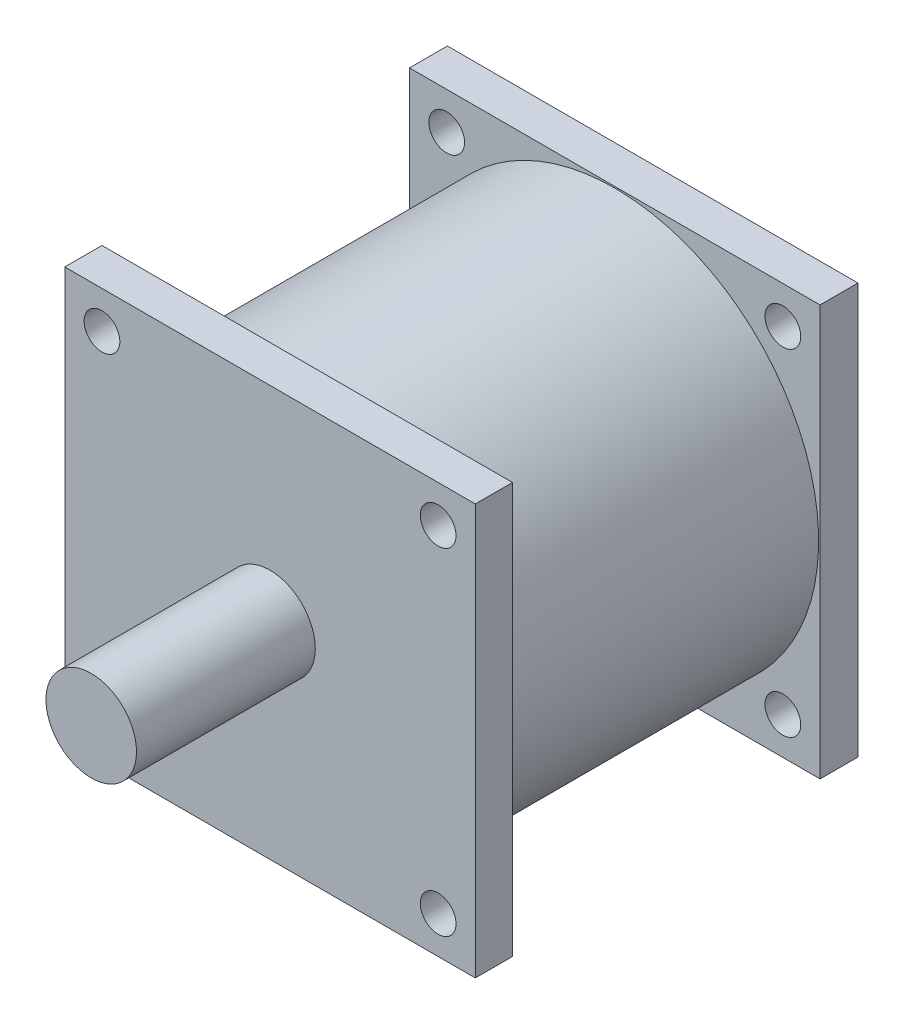
ISO-10303-21;
HEADER;
FILE_DESCRIPTION(('STEP AP214'),'2;1');
FILE_NAME('part.step','',(''),(''),'','','');
FILE_SCHEMA(('AUTOMOTIVE_DESIGN { 1 0 10303 214 1 1 1 1 }'));
ENDSEC;
DATA;
#1=APPLICATION_CONTEXT('core data for automotive mechanical design processes');
#2=APPLICATION_PROTOCOL_DEFINITION('international standard','automotive_design',2000,#1);
#3=PRODUCT_CONTEXT('',#1,'mechanical');
#4=PRODUCT('Part','Part','',(#3));
#5=PRODUCT_RELATED_PRODUCT_CATEGORY('part','',(#4));
#6=PRODUCT_DEFINITION_FORMATION('','',#4);
#7=PRODUCT_DEFINITION_CONTEXT('part definition',#1,'design');
#8=PRODUCT_DEFINITION('design','',#6,#7);
#9=PRODUCT_DEFINITION_SHAPE('','',#8);
#10=(LENGTH_UNIT() NAMED_UNIT(*) SI_UNIT(.MILLI.,.METRE.));
#11=(NAMED_UNIT(*) PLANE_ANGLE_UNIT() SI_UNIT($,.RADIAN.));
#12=(NAMED_UNIT(*) SI_UNIT($,.STERADIAN.) SOLID_ANGLE_UNIT());
#13=UNCERTAINTY_MEASURE_WITH_UNIT(LENGTH_MEASURE(1.E-05),#10,'distance_accuracy_value','');
#14=(GEOMETRIC_REPRESENTATION_CONTEXT(3) GLOBAL_UNCERTAINTY_ASSIGNED_CONTEXT((#13)) GLOBAL_UNIT_ASSIGNED_CONTEXT((#10,
#11,#12)) REPRESENTATION_CONTEXT('',''));
#15=CARTESIAN_POINT('',(0.,0.,0.));
#16=DIRECTION('',(0.,0.,1.));
#17=DIRECTION('',(1.,0.,0.));
#18=AXIS2_PLACEMENT_3D('',#15,#16,#17);
#19=CARTESIAN_POINT('',(0.,0.,48.2));
#20=DIRECTION('',(0.,0.,1.));
#21=DIRECTION('',(1.,0.,0.));
#22=AXIS2_PLACEMENT_3D('',#19,#20,#21);
#23=PLANE('',#22);
#24=CARTESIAN_POINT('',(-23.5,23.5,48.2));
#25=DIRECTION('',(0.,0.,1.));
#26=DIRECTION('',(1.,0.,0.));
#27=AXIS2_PLACEMENT_3D('',#24,#25,#26);
#28=CIRCLE('',#27,2.5);
#29=CARTESIAN_POINT('',(-21.,23.5,48.2));
#30=VERTEX_POINT('',#29);
#31=EDGE_CURVE('E441',#30,#30,#28,.T.);
#32=ORIENTED_EDGE('',*,*,#31,.F.);
#33=EDGE_LOOP('',(#32));
#34=FACE_BOUND('',#33,.T.);
#35=CARTESIAN_POINT('',(23.5,23.5,48.2));
#36=DIRECTION('',(0.,0.,1.));
#37=DIRECTION('',(1.,0.,0.));
#38=AXIS2_PLACEMENT_3D('',#35,#36,#37);
#39=CIRCLE('',#38,2.5);
#40=CARTESIAN_POINT('',(26.,23.5,48.2));
#41=VERTEX_POINT('',#40);
#42=EDGE_CURVE('E447',#41,#41,#39,.T.);
#43=ORIENTED_EDGE('',*,*,#42,.F.);
#44=EDGE_LOOP('',(#43));
#45=FACE_BOUND('',#44,.T.);
#46=CARTESIAN_POINT('',(23.5,-23.5,48.2));
#47=DIRECTION('',(0.,0.,1.));
#48=DIRECTION('',(1.,0.,0.));
#49=AXIS2_PLACEMENT_3D('',#46,#47,#48);
#50=CIRCLE('',#49,2.5);
#51=CARTESIAN_POINT('',(26.,-23.5,48.2));
#52=VERTEX_POINT('',#51);
#53=EDGE_CURVE('E453',#52,#52,#50,.T.);
#54=ORIENTED_EDGE('',*,*,#53,.F.);
#55=EDGE_LOOP('',(#54));
#56=FACE_BOUND('',#55,.T.);
#57=CARTESIAN_POINT('',(-23.5,-23.5,48.2));
#58=DIRECTION('',(0.,0.,1.));
#59=DIRECTION('',(1.,0.,0.));
#60=AXIS2_PLACEMENT_3D('',#57,#58,#59);
#61=CIRCLE('',#60,2.5);
#62=CARTESIAN_POINT('',(-21.,-23.5,48.2));
#63=VERTEX_POINT('',#62);
#64=EDGE_CURVE('E459',#63,#63,#61,.T.);
#65=ORIENTED_EDGE('',*,*,#64,.F.);
#66=EDGE_LOOP('',(#65));
#67=FACE_BOUND('',#66,.T.);
#68=DIRECTION('',(0.,1.,0.));
#69=VECTOR('',#68,1.);
#70=CARTESIAN_POINT('',(28.7,-28.7,48.2));
#71=LINE('',#70,#69);
#72=CARTESIAN_POINT('',(28.7,-28.7,48.2));
#73=VERTEX_POINT('',#72);
#74=CARTESIAN_POINT('',(28.7,28.7,48.2));
#75=VERTEX_POINT('',#74);
#76=EDGE_CURVE('E81',#73,#75,#71,.T.);
#77=ORIENTED_EDGE('',*,*,#76,.T.);
#78=DIRECTION('',(-1.,0.,0.));
#79=VECTOR('',#78,1.);
#80=CARTESIAN_POINT('',(28.7,28.7,48.2));
#81=LINE('',#80,#79);
#82=CARTESIAN_POINT('',(-28.7,28.7,48.2));
#83=VERTEX_POINT('',#82);
#84=EDGE_CURVE('E156',#75,#83,#81,.T.);
#85=ORIENTED_EDGE('',*,*,#84,.T.);
#86=DIRECTION('',(0.,-1.,0.));
#87=VECTOR('',#86,1.);
#88=CARTESIAN_POINT('',(-28.7,28.7,48.2));
#89=LINE('',#88,#87);
#90=CARTESIAN_POINT('',(-28.7,-28.7,48.2));
#91=VERTEX_POINT('',#90);
#92=EDGE_CURVE('E159',#83,#91,#89,.T.);
#93=ORIENTED_EDGE('',*,*,#92,.T.);
#94=DIRECTION('',(1.,0.,0.));
#95=VECTOR('',#94,1.);
#96=CARTESIAN_POINT('',(-28.7,-28.7,48.2));
#97=LINE('',#96,#95);
#98=EDGE_CURVE('E51',#91,#73,#97,.T.);
#99=ORIENTED_EDGE('',*,*,#98,.T.);
#100=EDGE_LOOP('',(#77,#85,#93,#99));
#101=FACE_BOUND('',#100,.T.);
#102=CARTESIAN_POINT('',(0.,0.,48.2));
#103=DIRECTION('',(0.,0.,1.));
#104=DIRECTION('',(1.,0.,0.));
#105=AXIS2_PLACEMENT_3D('',#102,#103,#104);
#106=CIRCLE('',#105,6.33);
#107=CARTESIAN_POINT('',(6.33,0.,48.2));
#108=VERTEX_POINT('',#107);
#109=EDGE_CURVE('E465',#108,#108,#106,.T.);
#110=ORIENTED_EDGE('',*,*,#109,.F.);
#111=EDGE_LOOP('',(#110));
#112=FACE_BOUND('',#111,.T.);
#113=ADVANCED_FACE('F34',(#34,#45,#56,#67,#101,#112),#23,.T.);
#114=CARTESIAN_POINT('',(0.,0.,43.));
#115=DIRECTION('',(0.,0.,-1.));
#116=DIRECTION('',(-1.,0.,0.));
#117=AXIS2_PLACEMENT_3D('',#114,#115,#116);
#118=CYLINDRICAL_SURFACE('',#117,28.5);
#119=CARTESIAN_POINT('',(0.,0.,43.));
#120=DIRECTION('',(0.,0.,1.));
#121=DIRECTION('',(1.,0.,0.));
#122=AXIS2_PLACEMENT_3D('',#119,#120,#121);
#123=CIRCLE('',#122,28.5);
#124=CARTESIAN_POINT('',(28.5,0.,43.));
#125=VERTEX_POINT('',#124);
#126=EDGE_CURVE('E11',#125,#125,#123,.T.);
#127=ORIENTED_EDGE('',*,*,#126,.F.);
#128=EDGE_LOOP('',(#127));
#129=FACE_BOUND('',#128,.T.);
#130=CARTESIAN_POINT('',(0.,0.,0.));
#131=DIRECTION('',(0.,0.,-1.));
#132=DIRECTION('',(-1.,0.,0.));
#133=AXIS2_PLACEMENT_3D('',#130,#131,#132);
#134=CIRCLE('',#133,28.5);
#135=CARTESIAN_POINT('',(-28.5,0.,0.));
#136=VERTEX_POINT('',#135);
#137=EDGE_CURVE('E127',#136,#136,#134,.T.);
#138=ORIENTED_EDGE('',*,*,#137,.F.);
#139=EDGE_LOOP('',(#138));
#140=FACE_BOUND('',#139,.T.);
#141=ADVANCED_FACE('F36',(#129,#140),#118,.T.);
#142=CARTESIAN_POINT('',(0.,0.,43.));
#143=DIRECTION('',(0.,0.,1.));
#144=DIRECTION('',(1.,0.,0.));
#145=AXIS2_PLACEMENT_3D('',#142,#143,#144);
#146=PLANE('',#145);
#147=CARTESIAN_POINT('',(-23.5,23.5,43.));
#148=DIRECTION('',(0.,0.,1.));
#149=DIRECTION('',(1.,0.,0.));
#150=AXIS2_PLACEMENT_3D('',#147,#148,#149);
#151=CIRCLE('',#150,2.5);
#152=CARTESIAN_POINT('',(-21.,23.5,43.));
#153=VERTEX_POINT('',#152);
#154=EDGE_CURVE('E444',#153,#153,#151,.T.);
#155=ORIENTED_EDGE('',*,*,#154,.T.);
#156=EDGE_LOOP('',(#155));
#157=FACE_BOUND('',#156,.T.);
#158=CARTESIAN_POINT('',(23.5,23.5,43.));
#159=DIRECTION('',(0.,0.,1.));
#160=DIRECTION('',(1.,0.,0.));
#161=AXIS2_PLACEMENT_3D('',#158,#159,#160);
#162=CIRCLE('',#161,2.5);
#163=CARTESIAN_POINT('',(26.,23.5,43.));
#164=VERTEX_POINT('',#163);
#165=EDGE_CURVE('E450',#164,#164,#162,.T.);
#166=ORIENTED_EDGE('',*,*,#165,.T.);
#167=EDGE_LOOP('',(#166));
#168=FACE_BOUND('',#167,.T.);
#169=CARTESIAN_POINT('',(23.5,-23.5,43.));
#170=DIRECTION('',(0.,0.,1.));
#171=DIRECTION('',(1.,0.,0.));
#172=AXIS2_PLACEMENT_3D('',#169,#170,#171);
#173=CIRCLE('',#172,2.5);
#174=CARTESIAN_POINT('',(26.,-23.5,43.));
#175=VERTEX_POINT('',#174);
#176=EDGE_CURVE('E456',#175,#175,#173,.T.);
#177=ORIENTED_EDGE('',*,*,#176,.T.);
#178=EDGE_LOOP('',(#177));
#179=FACE_BOUND('',#178,.T.);
#180=CARTESIAN_POINT('',(-23.5,-23.5,43.));
#181=DIRECTION('',(0.,0.,1.));
#182=DIRECTION('',(1.,0.,0.));
#183=AXIS2_PLACEMENT_3D('',#180,#181,#182);
#184=CIRCLE('',#183,2.5);
#185=CARTESIAN_POINT('',(-21.,-23.5,43.));
#186=VERTEX_POINT('',#185);
#187=EDGE_CURVE('E462',#186,#186,#184,.T.);
#188=ORIENTED_EDGE('',*,*,#187,.T.);
#189=EDGE_LOOP('',(#188));
#190=FACE_BOUND('',#189,.T.);
#191=DIRECTION('',(0.,1.,0.));
#192=VECTOR('',#191,1.);
#193=CARTESIAN_POINT('',(28.7,0.,43.));
#194=LINE('',#193,#192);
#195=CARTESIAN_POINT('',(28.7,-28.7,43.));
#196=VERTEX_POINT('',#195);
#197=CARTESIAN_POINT('',(28.7,28.7,43.));
#198=VERTEX_POINT('',#197);
#199=EDGE_CURVE('E76',#196,#198,#194,.T.);
#200=ORIENTED_EDGE('',*,*,#199,.F.);
#201=DIRECTION('',(1.,0.,0.));
#202=VECTOR('',#201,1.);
#203=CARTESIAN_POINT('',(-28.7,-28.7,43.));
#204=LINE('',#203,#202);
#205=CARTESIAN_POINT('',(-28.7,-28.7,43.));
#206=VERTEX_POINT('',#205);
#207=EDGE_CURVE('E157',#206,#196,#204,.T.);
#208=ORIENTED_EDGE('',*,*,#207,.F.);
#209=DIRECTION('',(0.,-1.,0.));
#210=VECTOR('',#209,1.);
#211=CARTESIAN_POINT('',(-28.7,28.7,43.));
#212=LINE('',#211,#210);
#213=CARTESIAN_POINT('',(-28.7,28.7,43.));
#214=VERTEX_POINT('',#213);
#215=EDGE_CURVE('E69',#214,#206,#212,.T.);
#216=ORIENTED_EDGE('',*,*,#215,.F.);
#217=DIRECTION('',(-1.,0.,0.));
#218=VECTOR('',#217,1.);
#219=CARTESIAN_POINT('',(28.7,28.7,43.));
#220=LINE('',#219,#218);
#221=EDGE_CURVE('E164',#198,#214,#220,.T.);
#222=ORIENTED_EDGE('',*,*,#221,.F.);
#223=EDGE_LOOP('',(#200,#208,#216,#222));
#224=FACE_BOUND('',#223,.T.);
#225=ORIENTED_EDGE('',*,*,#126,.T.);
#226=EDGE_LOOP('',(#225));
#227=FACE_BOUND('',#226,.T.);
#228=ADVANCED_FACE('F179',(#157,#168,#179,#190,#224,#227),#146,.F.);
#229=CARTESIAN_POINT('',(28.7,0.,48.2));
#230=DIRECTION('',(-1.,0.,0.));
#231=DIRECTION('',(0.,0.,1.));
#232=AXIS2_PLACEMENT_3D('',#229,#230,#231);
#233=PLANE('',#232);
#234=ORIENTED_EDGE('',*,*,#199,.T.);
#235=DIRECTION('',(0.,0.,-1.));
#236=VECTOR('',#235,1.);
#237=CARTESIAN_POINT('',(28.7,28.7,48.2));
#238=LINE('',#237,#236);
#239=EDGE_CURVE('E43',#75,#198,#238,.T.);
#240=ORIENTED_EDGE('',*,*,#239,.F.);
#241=ORIENTED_EDGE('',*,*,#76,.F.);
#242=DIRECTION('',(0.,0.,-1.));
#243=VECTOR('',#242,1.);
#244=CARTESIAN_POINT('',(28.7,-28.7,48.2));
#245=LINE('',#244,#243);
#246=EDGE_CURVE('E162',#73,#196,#245,.T.);
#247=ORIENTED_EDGE('',*,*,#246,.T.);
#248=EDGE_LOOP('',(#234,#240,#241,#247));
#249=FACE_BOUND('',#248,.T.);
#250=ADVANCED_FACE('F183',(#249),#233,.F.);
#251=CARTESIAN_POINT('',(28.7,28.7,48.2));
#252=DIRECTION('',(0.,-1.,0.));
#253=DIRECTION('',(1.,0.,0.));
#254=AXIS2_PLACEMENT_3D('',#251,#252,#253);
#255=PLANE('',#254);
#256=ORIENTED_EDGE('',*,*,#221,.T.);
#257=DIRECTION('',(0.,0.,-1.));
#258=VECTOR('',#257,1.);
#259=CARTESIAN_POINT('',(-28.7,28.7,48.2));
#260=LINE('',#259,#258);
#261=EDGE_CURVE('E172',#83,#214,#260,.T.);
#262=ORIENTED_EDGE('',*,*,#261,.F.);
#263=ORIENTED_EDGE('',*,*,#84,.F.);
#264=ORIENTED_EDGE('',*,*,#239,.T.);
#265=EDGE_LOOP('',(#256,#262,#263,#264));
#266=FACE_BOUND('',#265,.T.);
#267=ADVANCED_FACE('F176',(#266),#255,.F.);
#268=CARTESIAN_POINT('',(-28.7,28.7,48.2));
#269=DIRECTION('',(1.,0.,0.));
#270=DIRECTION('',(0.,1.,0.));
#271=AXIS2_PLACEMENT_3D('',#268,#269,#270);
#272=PLANE('',#271);
#273=ORIENTED_EDGE('',*,*,#215,.T.);
#274=DIRECTION('',(0.,0.,-1.));
#275=VECTOR('',#274,1.);
#276=CARTESIAN_POINT('',(-28.7,-28.7,48.2));
#277=LINE('',#276,#275);
#278=EDGE_CURVE('E170',#91,#206,#277,.T.);
#279=ORIENTED_EDGE('',*,*,#278,.F.);
#280=ORIENTED_EDGE('',*,*,#92,.F.);
#281=ORIENTED_EDGE('',*,*,#261,.T.);
#282=EDGE_LOOP('',(#273,#279,#280,#281));
#283=FACE_BOUND('',#282,.T.);
#284=ADVANCED_FACE('F189',(#283),#272,.F.);
#285=CARTESIAN_POINT('',(-28.7,-28.7,48.2));
#286=DIRECTION('',(0.,1.,0.));
#287=DIRECTION('',(-1.,0.,0.));
#288=AXIS2_PLACEMENT_3D('',#285,#286,#287);
#289=PLANE('',#288);
#290=ORIENTED_EDGE('',*,*,#207,.T.);
#291=ORIENTED_EDGE('',*,*,#246,.F.);
#292=ORIENTED_EDGE('',*,*,#98,.F.);
#293=ORIENTED_EDGE('',*,*,#278,.T.);
#294=EDGE_LOOP('',(#290,#291,#292,#293));
#295=FACE_BOUND('',#294,.T.);
#296=ADVANCED_FACE('F182',(#295),#289,.F.);
#297=CARTESIAN_POINT('',(0.,0.,0.));
#298=DIRECTION('',(0.,0.,-1.));
#299=DIRECTION('',(-1.,0.,0.));
#300=AXIS2_PLACEMENT_3D('',#297,#298,#299);
#301=PLANE('',#300);
#302=CARTESIAN_POINT('',(-23.5,23.5,0.));
#303=DIRECTION('',(0.,0.,-1.));
#304=DIRECTION('',(-1.,0.,0.));
#305=AXIS2_PLACEMENT_3D('',#302,#303,#304);
#306=CIRCLE('',#305,2.49999999999999);
#307=CARTESIAN_POINT('',(-26.,23.5,0.));
#308=VERTEX_POINT('',#307);
#309=EDGE_CURVE('E419',#308,#308,#306,.T.);
#310=ORIENTED_EDGE('',*,*,#309,.T.);
#311=EDGE_LOOP('',(#310));
#312=FACE_BOUND('',#311,.T.);
#313=CARTESIAN_POINT('',(23.5,23.5,0.));
#314=DIRECTION('',(0.,0.,-1.));
#315=DIRECTION('',(-1.,0.,0.));
#316=AXIS2_PLACEMENT_3D('',#313,#314,#315);
#317=CIRCLE('',#316,2.49999999999999);
#318=CARTESIAN_POINT('',(21.,23.5,0.));
#319=VERTEX_POINT('',#318);
#320=EDGE_CURVE('E423',#319,#319,#317,.T.);
#321=ORIENTED_EDGE('',*,*,#320,.T.);
#322=EDGE_LOOP('',(#321));
#323=FACE_BOUND('',#322,.T.);
#324=CARTESIAN_POINT('',(23.5,-23.5,0.));
#325=DIRECTION('',(0.,0.,-1.));
#326=DIRECTION('',(-1.,0.,0.));
#327=AXIS2_PLACEMENT_3D('',#324,#325,#326);
#328=CIRCLE('',#327,2.49999999999999);
#329=CARTESIAN_POINT('',(21.,-23.5,0.));
#330=VERTEX_POINT('',#329);
#331=EDGE_CURVE('E432',#330,#330,#328,.T.);
#332=ORIENTED_EDGE('',*,*,#331,.T.);
#333=EDGE_LOOP('',(#332));
#334=FACE_BOUND('',#333,.T.);
#335=CARTESIAN_POINT('',(-23.5,-23.5,0.));
#336=DIRECTION('',(0.,0.,-1.));
#337=DIRECTION('',(-1.,0.,0.));
#338=AXIS2_PLACEMENT_3D('',#335,#336,#337);
#339=CIRCLE('',#338,2.49999999999999);
#340=CARTESIAN_POINT('',(-26.,-23.5,0.));
#341=VERTEX_POINT('',#340);
#342=EDGE_CURVE('E438',#341,#341,#339,.T.);
#343=ORIENTED_EDGE('',*,*,#342,.T.);
#344=EDGE_LOOP('',(#343));
#345=FACE_BOUND('',#344,.T.);
#346=DIRECTION('',(0.,1.,0.));
#347=VECTOR('',#346,1.);
#348=CARTESIAN_POINT('',(-28.7,0.,0.));
#349=LINE('',#348,#347);
#350=CARTESIAN_POINT('',(-28.7,-28.7,0.));
#351=VERTEX_POINT('',#350);
#352=CARTESIAN_POINT('',(-28.7,28.7,0.));
#353=VERTEX_POINT('',#352);
#354=EDGE_CURVE('E124',#351,#353,#349,.T.);
#355=ORIENTED_EDGE('',*,*,#354,.F.);
#356=DIRECTION('',(-1.,0.,0.));
#357=VECTOR('',#356,1.);
#358=CARTESIAN_POINT('',(28.7,-28.7,0.));
#359=LINE('',#358,#357);
#360=CARTESIAN_POINT('',(28.7,-28.7,0.));
#361=VERTEX_POINT('',#360);
#362=EDGE_CURVE('E119',#361,#351,#359,.T.);
#363=ORIENTED_EDGE('',*,*,#362,.F.);
#364=DIRECTION('',(0.,-1.,0.));
#365=VECTOR('',#364,1.);
#366=CARTESIAN_POINT('',(28.7,28.7,0.));
#367=LINE('',#366,#365);
#368=CARTESIAN_POINT('',(28.7,28.7,0.));
#369=VERTEX_POINT('',#368);
#370=EDGE_CURVE('E144',#369,#361,#367,.T.);
#371=ORIENTED_EDGE('',*,*,#370,.F.);
#372=DIRECTION('',(1.,0.,0.));
#373=VECTOR('',#372,1.);
#374=CARTESIAN_POINT('',(-28.7,28.7,0.));
#375=LINE('',#374,#373);
#376=EDGE_CURVE('E141',#353,#369,#375,.T.);
#377=ORIENTED_EDGE('',*,*,#376,.F.);
#378=EDGE_LOOP('',(#355,#363,#371,#377));
#379=FACE_BOUND('',#378,.T.);
#380=ORIENTED_EDGE('',*,*,#137,.T.);
#381=EDGE_LOOP('',(#380));
#382=FACE_BOUND('',#381,.T.);
#383=ADVANCED_FACE('F207',(#312,#323,#334,#345,#379,#382),#301,.F.);
#384=CARTESIAN_POINT('',(-28.7,0.,-5.3));
#385=DIRECTION('',(1.,0.,0.));
#386=DIRECTION('',(0.,0.,-1.));
#387=AXIS2_PLACEMENT_3D('',#384,#385,#386);
#388=PLANE('',#387);
#389=ORIENTED_EDGE('',*,*,#354,.T.);
#390=DIRECTION('',(0.,0.,1.));
#391=VECTOR('',#390,1.);
#392=CARTESIAN_POINT('',(-28.7,28.7,-5.3));
#393=LINE('',#392,#391);
#394=CARTESIAN_POINT('',(-28.7,28.7,-5.3));
#395=VERTEX_POINT('',#394);
#396=EDGE_CURVE('E122',#395,#353,#393,.T.);
#397=ORIENTED_EDGE('',*,*,#396,.F.);
#398=DIRECTION('',(0.,1.,0.));
#399=VECTOR('',#398,1.);
#400=CARTESIAN_POINT('',(-28.7,-28.7,-5.3));
#401=LINE('',#400,#399);
#402=CARTESIAN_POINT('',(-28.7,-28.7,-5.3));
#403=VERTEX_POINT('',#402);
#404=EDGE_CURVE('E108',#403,#395,#401,.T.);
#405=ORIENTED_EDGE('',*,*,#404,.F.);
#406=DIRECTION('',(0.,0.,1.));
#407=VECTOR('',#406,1.);
#408=CARTESIAN_POINT('',(-28.7,-28.7,-5.3));
#409=LINE('',#408,#407);
#410=EDGE_CURVE('E139',#403,#351,#409,.T.);
#411=ORIENTED_EDGE('',*,*,#410,.T.);
#412=EDGE_LOOP('',(#389,#397,#405,#411));
#413=FACE_BOUND('',#412,.T.);
#414=ADVANCED_FACE('F123',(#413),#388,.F.);
#415=CARTESIAN_POINT('',(-28.7,28.7,-5.3));
#416=DIRECTION('',(0.,-1.,0.));
#417=DIRECTION('',(1.,0.,0.));
#418=AXIS2_PLACEMENT_3D('',#415,#416,#417);
#419=PLANE('',#418);
#420=ORIENTED_EDGE('',*,*,#376,.T.);
#421=DIRECTION('',(0.,0.,1.));
#422=VECTOR('',#421,1.);
#423=CARTESIAN_POINT('',(28.7,28.7,-5.3));
#424=LINE('',#423,#422);
#425=CARTESIAN_POINT('',(28.7,28.7,-5.3));
#426=VERTEX_POINT('',#425);
#427=EDGE_CURVE('E128',#426,#369,#424,.T.);
#428=ORIENTED_EDGE('',*,*,#427,.F.);
#429=DIRECTION('',(1.,0.,0.));
#430=VECTOR('',#429,1.);
#431=CARTESIAN_POINT('',(-28.7,28.7,-5.3));
#432=LINE('',#431,#430);
#433=EDGE_CURVE('E112',#395,#426,#432,.T.);
#434=ORIENTED_EDGE('',*,*,#433,.F.);
#435=ORIENTED_EDGE('',*,*,#396,.T.);
#436=EDGE_LOOP('',(#420,#428,#434,#435));
#437=FACE_BOUND('',#436,.T.);
#438=ADVANCED_FACE('F130',(#437),#419,.F.);
#439=CARTESIAN_POINT('',(28.7,28.7,-5.3));
#440=DIRECTION('',(-1.,0.,0.));
#441=DIRECTION('',(0.,-1.,0.));
#442=AXIS2_PLACEMENT_3D('',#439,#440,#441);
#443=PLANE('',#442);
#444=ORIENTED_EDGE('',*,*,#370,.T.);
#445=DIRECTION('',(0.,0.,1.));
#446=VECTOR('',#445,1.);
#447=CARTESIAN_POINT('',(28.7,-28.7,-5.3));
#448=LINE('',#447,#446);
#449=CARTESIAN_POINT('',(28.7,-28.7,-5.3));
#450=VERTEX_POINT('',#449);
#451=EDGE_CURVE('E149',#450,#361,#448,.T.);
#452=ORIENTED_EDGE('',*,*,#451,.F.);
#453=DIRECTION('',(0.,-1.,0.));
#454=VECTOR('',#453,1.);
#455=CARTESIAN_POINT('',(28.7,28.7,-5.3));
#456=LINE('',#455,#454);
#457=EDGE_CURVE('E133',#426,#450,#456,.T.);
#458=ORIENTED_EDGE('',*,*,#457,.F.);
#459=ORIENTED_EDGE('',*,*,#427,.T.);
#460=EDGE_LOOP('',(#444,#452,#458,#459));
#461=FACE_BOUND('',#460,.T.);
#462=ADVANCED_FACE('F237',(#461),#443,.F.);
#463=CARTESIAN_POINT('',(28.7,-28.7,-5.3));
#464=DIRECTION('',(0.,1.,0.));
#465=DIRECTION('',(0.,0.,1.));
#466=AXIS2_PLACEMENT_3D('',#463,#464,#465);
#467=PLANE('',#466);
#468=ORIENTED_EDGE('',*,*,#362,.T.);
#469=ORIENTED_EDGE('',*,*,#410,.F.);
#470=DIRECTION('',(-1.,0.,0.));
#471=VECTOR('',#470,1.);
#472=CARTESIAN_POINT('',(28.7,-28.7,-5.3));
#473=LINE('',#472,#471);
#474=EDGE_CURVE('E115',#450,#403,#473,.T.);
#475=ORIENTED_EDGE('',*,*,#474,.F.);
#476=ORIENTED_EDGE('',*,*,#451,.T.);
#477=EDGE_LOOP('',(#468,#469,#475,#476));
#478=FACE_BOUND('',#477,.T.);
#479=ADVANCED_FACE('F243',(#478),#467,.F.);
#480=CARTESIAN_POINT('',(0.,0.,-5.3));
#481=DIRECTION('',(0.,0.,-1.));
#482=DIRECTION('',(-1.,0.,0.));
#483=AXIS2_PLACEMENT_3D('',#480,#481,#482);
#484=PLANE('',#483);
#485=CARTESIAN_POINT('',(-23.5,23.5,-5.3));
#486=DIRECTION('',(0.,0.,1.));
#487=DIRECTION('',(1.,0.,0.));
#488=AXIS2_PLACEMENT_3D('',#485,#486,#487);
#489=CIRCLE('',#488,2.49999999999999);
#490=CARTESIAN_POINT('',(-21.,23.5,-5.3));
#491=VERTEX_POINT('',#490);
#492=EDGE_CURVE('E416',#491,#491,#489,.T.);
#493=ORIENTED_EDGE('',*,*,#492,.T.);
#494=EDGE_LOOP('',(#493));
#495=FACE_BOUND('',#494,.T.);
#496=CARTESIAN_POINT('',(23.5,23.5,-5.3));
#497=DIRECTION('',(0.,0.,1.));
#498=DIRECTION('',(1.,0.,0.));
#499=AXIS2_PLACEMENT_3D('',#496,#497,#498);
#500=CIRCLE('',#499,2.49999999999999);
#501=CARTESIAN_POINT('',(26.,23.5,-5.3));
#502=VERTEX_POINT('',#501);
#503=EDGE_CURVE('E420',#502,#502,#500,.T.);
#504=ORIENTED_EDGE('',*,*,#503,.T.);
#505=EDGE_LOOP('',(#504));
#506=FACE_BOUND('',#505,.T.);
#507=CARTESIAN_POINT('',(23.5,-23.5,-5.3));
#508=DIRECTION('',(0.,0.,1.));
#509=DIRECTION('',(1.,0.,0.));
#510=AXIS2_PLACEMENT_3D('',#507,#508,#509);
#511=CIRCLE('',#510,2.49999999999999);
#512=CARTESIAN_POINT('',(26.,-23.5,-5.3));
#513=VERTEX_POINT('',#512);
#514=EDGE_CURVE('E429',#513,#513,#511,.T.);
#515=ORIENTED_EDGE('',*,*,#514,.T.);
#516=EDGE_LOOP('',(#515));
#517=FACE_BOUND('',#516,.T.);
#518=CARTESIAN_POINT('',(-23.5,-23.5,-5.3));
#519=DIRECTION('',(0.,0.,1.));
#520=DIRECTION('',(1.,0.,0.));
#521=AXIS2_PLACEMENT_3D('',#518,#519,#520);
#522=CIRCLE('',#521,2.49999999999999);
#523=CARTESIAN_POINT('',(-21.,-23.5,-5.3));
#524=VERTEX_POINT('',#523);
#525=EDGE_CURVE('E435',#524,#524,#522,.T.);
#526=ORIENTED_EDGE('',*,*,#525,.T.);
#527=EDGE_LOOP('',(#526));
#528=FACE_BOUND('',#527,.T.);
#529=ORIENTED_EDGE('',*,*,#404,.T.);
#530=ORIENTED_EDGE('',*,*,#433,.T.);
#531=ORIENTED_EDGE('',*,*,#457,.T.);
#532=ORIENTED_EDGE('',*,*,#474,.T.);
#533=EDGE_LOOP('',(#529,#530,#531,#532));
#534=FACE_BOUND('',#533,.T.);
#535=ADVANCED_FACE('F110',(#495,#506,#517,#528,#534),#484,.T.);
#536=CARTESIAN_POINT('',(0.,0.,73.2));
#537=DIRECTION('',(0.,0.,-1.));
#538=DIRECTION('',(-1.,0.,0.));
#539=AXIS2_PLACEMENT_3D('',#536,#537,#538);
#540=CYLINDRICAL_SURFACE('',#539,6.33);
#541=CARTESIAN_POINT('',(0.,0.,73.2));
#542=DIRECTION('',(0.,0.,1.));
#543=DIRECTION('',(1.,0.,0.));
#544=AXIS2_PLACEMENT_3D('',#541,#542,#543);
#545=CIRCLE('',#544,6.33);
#546=CARTESIAN_POINT('',(6.33,0.,73.2));
#547=VERTEX_POINT('',#546);
#548=EDGE_CURVE('E142',#547,#547,#545,.T.);
#549=ORIENTED_EDGE('',*,*,#548,.F.);
#550=EDGE_LOOP('',(#549));
#551=FACE_BOUND('',#550,.T.);
#552=ORIENTED_EDGE('',*,*,#109,.T.);
#553=EDGE_LOOP('',(#552));
#554=FACE_BOUND('',#553,.T.);
#555=ADVANCED_FACE('F258',(#551,#554),#540,.T.);
#556=CARTESIAN_POINT('',(0.,0.,73.2));
#557=DIRECTION('',(0.,0.,1.));
#558=DIRECTION('',(1.,0.,0.));
#559=AXIS2_PLACEMENT_3D('',#556,#557,#558);
#560=PLANE('',#559);
#561=ORIENTED_EDGE('',*,*,#548,.T.);
#562=EDGE_LOOP('',(#561));
#563=FACE_BOUND('',#562,.T.);
#564=ADVANCED_FACE('F266',(#563),#560,.T.);
#565=CARTESIAN_POINT('',(-23.5,-23.5,48.2));
#566=DIRECTION('',(0.,0.,1.));
#567=DIRECTION('',(1.,0.,0.));
#568=AXIS2_PLACEMENT_3D('',#565,#566,#567);
#569=CYLINDRICAL_SURFACE('',#568,2.5);
#570=ORIENTED_EDGE('',*,*,#187,.F.);
#571=EDGE_LOOP('',(#570));
#572=FACE_BOUND('',#571,.T.);
#573=ORIENTED_EDGE('',*,*,#64,.T.);
#574=EDGE_LOOP('',(#573));
#575=FACE_BOUND('',#574,.T.);
#576=ADVANCED_FACE('F274',(#572,#575),#569,.F.);
#577=CARTESIAN_POINT('',(23.5,-23.5,48.2));
#578=DIRECTION('',(0.,0.,1.));
#579=DIRECTION('',(1.,0.,0.));
#580=AXIS2_PLACEMENT_3D('',#577,#578,#579);
#581=CYLINDRICAL_SURFACE('',#580,2.5);
#582=ORIENTED_EDGE('',*,*,#176,.F.);
#583=EDGE_LOOP('',(#582));
#584=FACE_BOUND('',#583,.T.);
#585=ORIENTED_EDGE('',*,*,#53,.T.);
#586=EDGE_LOOP('',(#585));
#587=FACE_BOUND('',#586,.T.);
#588=ADVANCED_FACE('F282',(#584,#587),#581,.F.);
#589=CARTESIAN_POINT('',(23.5,23.5,48.2));
#590=DIRECTION('',(0.,0.,1.));
#591=DIRECTION('',(1.,0.,0.));
#592=AXIS2_PLACEMENT_3D('',#589,#590,#591);
#593=CYLINDRICAL_SURFACE('',#592,2.5);
#594=ORIENTED_EDGE('',*,*,#165,.F.);
#595=EDGE_LOOP('',(#594));
#596=FACE_BOUND('',#595,.T.);
#597=ORIENTED_EDGE('',*,*,#42,.T.);
#598=EDGE_LOOP('',(#597));
#599=FACE_BOUND('',#598,.T.);
#600=ADVANCED_FACE('F290',(#596,#599),#593,.F.);
#601=CARTESIAN_POINT('',(-23.5,23.5,48.2));
#602=DIRECTION('',(0.,0.,1.));
#603=DIRECTION('',(1.,0.,0.));
#604=AXIS2_PLACEMENT_3D('',#601,#602,#603);
#605=CYLINDRICAL_SURFACE('',#604,2.5);
#606=ORIENTED_EDGE('',*,*,#154,.F.);
#607=EDGE_LOOP('',(#606));
#608=FACE_BOUND('',#607,.T.);
#609=ORIENTED_EDGE('',*,*,#31,.T.);
#610=EDGE_LOOP('',(#609));
#611=FACE_BOUND('',#610,.T.);
#612=ADVANCED_FACE('F298',(#608,#611),#605,.F.);
#613=CARTESIAN_POINT('',(-23.5,-23.5,48.2));
#614=DIRECTION('',(0.,0.,1.));
#615=DIRECTION('',(1.,0.,0.));
#616=AXIS2_PLACEMENT_3D('',#613,#614,#615);
#617=CYLINDRICAL_SURFACE('',#616,2.49999999999999);
#618=ORIENTED_EDGE('',*,*,#525,.F.);
#619=EDGE_LOOP('',(#618));
#620=FACE_BOUND('',#619,.T.);
#621=ORIENTED_EDGE('',*,*,#342,.F.);
#622=EDGE_LOOP('',(#621));
#623=FACE_BOUND('',#622,.T.);
#624=ADVANCED_FACE('F306',(#620,#623),#617,.F.);
#625=CARTESIAN_POINT('',(23.5,-23.5,48.2));
#626=DIRECTION('',(0.,0.,1.));
#627=DIRECTION('',(1.,0.,0.));
#628=AXIS2_PLACEMENT_3D('',#625,#626,#627);
#629=CYLINDRICAL_SURFACE('',#628,2.49999999999999);
#630=ORIENTED_EDGE('',*,*,#514,.F.);
#631=EDGE_LOOP('',(#630));
#632=FACE_BOUND('',#631,.T.);
#633=ORIENTED_EDGE('',*,*,#331,.F.);
#634=EDGE_LOOP('',(#633));
#635=FACE_BOUND('',#634,.T.);
#636=ADVANCED_FACE('F312',(#632,#635),#629,.F.);
#637=CARTESIAN_POINT('',(23.5,23.5,48.2));
#638=DIRECTION('',(0.,0.,1.));
#639=DIRECTION('',(1.,0.,0.));
#640=AXIS2_PLACEMENT_3D('',#637,#638,#639);
#641=CYLINDRICAL_SURFACE('',#640,2.49999999999999);
#642=ORIENTED_EDGE('',*,*,#503,.F.);
#643=EDGE_LOOP('',(#642));
#644=FACE_BOUND('',#643,.T.);
#645=ORIENTED_EDGE('',*,*,#320,.F.);
#646=EDGE_LOOP('',(#645));
#647=FACE_BOUND('',#646,.T.);
#648=ADVANCED_FACE('F320',(#644,#647),#641,.F.);
#649=CARTESIAN_POINT('',(-23.5,23.5,48.2));
#650=DIRECTION('',(0.,0.,1.));
#651=DIRECTION('',(1.,0.,0.));
#652=AXIS2_PLACEMENT_3D('',#649,#650,#651);
#653=CYLINDRICAL_SURFACE('',#652,2.49999999999999);
#654=ORIENTED_EDGE('',*,*,#492,.F.);
#655=EDGE_LOOP('',(#654));
#656=FACE_BOUND('',#655,.T.);
#657=ORIENTED_EDGE('',*,*,#309,.F.);
#658=EDGE_LOOP('',(#657));
#659=FACE_BOUND('',#658,.T.);
#660=ADVANCED_FACE('F328',(#656,#659),#653,.F.);
#661=CLOSED_SHELL('',(#113,#141,#228,#250,#267,#284,#296,#383,#414,#438,#462,#479,#535,#555,
#564,#576,#588,#600,#612,#624,#636,#648,#660));
#662=MANIFOLD_SOLID_BREP('B2',#661);
#663=ADVANCED_BREP_SHAPE_REPRESENTATION('',(#18,#662),#14);
#664=SHAPE_DEFINITION_REPRESENTATION(#9,#663);
ENDSEC;
END-ISO-10303-21;
